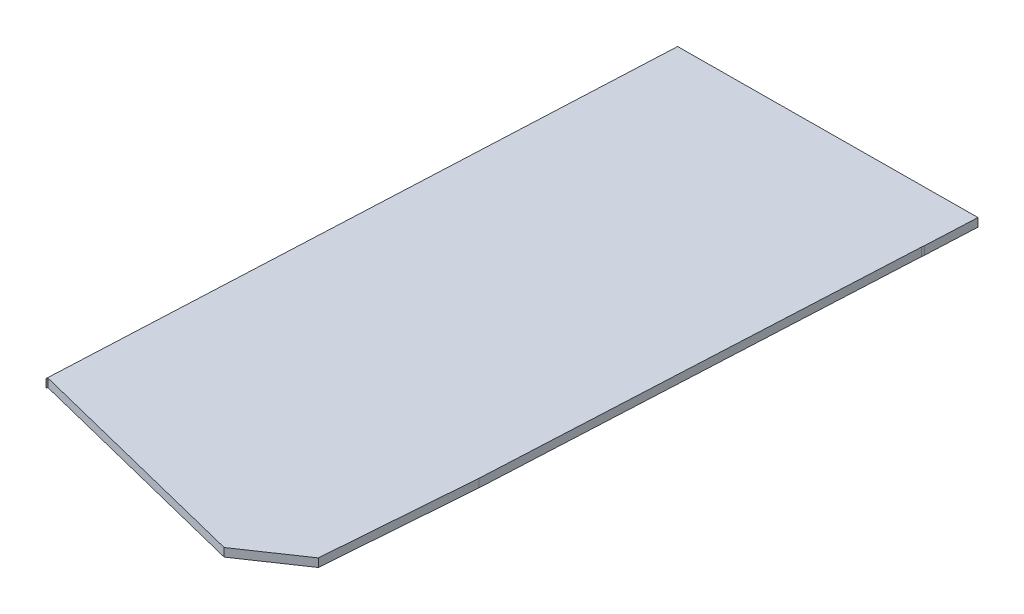
ISO-10303-21;
HEADER;
FILE_DESCRIPTION(('STEP AP214'),'2;1');
FILE_NAME('part.step','',(''),(''),'','','');
FILE_SCHEMA(('AUTOMOTIVE_DESIGN { 1 0 10303 214 1 1 1 1 }'));
ENDSEC;
DATA;
#1=APPLICATION_CONTEXT('core data for automotive mechanical design processes');
#2=APPLICATION_PROTOCOL_DEFINITION('international standard','automotive_design',2000,#1);
#3=PRODUCT_CONTEXT('',#1,'mechanical');
#4=PRODUCT('Part','Part','',(#3));
#5=PRODUCT_RELATED_PRODUCT_CATEGORY('part','',(#4));
#6=PRODUCT_DEFINITION_FORMATION('','',#4);
#7=PRODUCT_DEFINITION_CONTEXT('part definition',#1,'design');
#8=PRODUCT_DEFINITION('design','',#6,#7);
#9=PRODUCT_DEFINITION_SHAPE('','',#8);
#10=(LENGTH_UNIT() NAMED_UNIT(*) SI_UNIT(.MILLI.,.METRE.));
#11=(NAMED_UNIT(*) PLANE_ANGLE_UNIT() SI_UNIT($,.RADIAN.));
#12=(NAMED_UNIT(*) SI_UNIT($,.STERADIAN.) SOLID_ANGLE_UNIT());
#13=UNCERTAINTY_MEASURE_WITH_UNIT(LENGTH_MEASURE(1.E-05),#10,'distance_accuracy_value','');
#14=(GEOMETRIC_REPRESENTATION_CONTEXT(3) GLOBAL_UNCERTAINTY_ASSIGNED_CONTEXT((#13)) GLOBAL_UNIT_ASSIGNED_CONTEXT((#10,
#11,#12)) REPRESENTATION_CONTEXT('',''));
#15=CARTESIAN_POINT('',(0.,0.,0.));
#16=DIRECTION('',(0.,0.,1.));
#17=DIRECTION('',(1.,0.,0.));
#18=AXIS2_PLACEMENT_3D('',#15,#16,#17);
#19=CARTESIAN_POINT('',(78.5122731177693,2.,-145.5720124045));
#20=DIRECTION('',(0.00706068551905214,0.,0.999975073049324));
#21=DIRECTION('',(0.999975073049324,0.,-0.00706068551905214));
#22=AXIS2_PLACEMENT_3D('',#19,#20,#21);
#23=PLANE('',#22);
#24=DIRECTION('',(-0.999975073049324,0.,0.00706068551905214));
#25=VECTOR('',#24,1.);
#26=CARTESIAN_POINT('',(78.5122731177693,0.,-145.5720124045));
#27=LINE('',#26,#25);
#28=CARTESIAN_POINT('',(78.5122731177693,0.,-145.5720124045));
#29=VERTEX_POINT('',#28);
#30=CARTESIAN_POINT('',(6.79132851475084,0.,-145.06560074623));
#31=VERTEX_POINT('',#30);
#32=EDGE_CURVE('E146',#29,#31,#27,.T.);
#33=ORIENTED_EDGE('',*,*,#32,.T.);
#34=DIRECTION('',(0.,-1.,0.));
#35=VECTOR('',#34,1.);
#36=CARTESIAN_POINT('',(6.79132851475084,2.,-145.06560074623));
#37=LINE('',#36,#35);
#38=CARTESIAN_POINT('',(6.79132851475084,2.,-145.06560074623));
#39=VERTEX_POINT('',#38);
#40=EDGE_CURVE('E11',#39,#31,#37,.T.);
#41=ORIENTED_EDGE('',*,*,#40,.F.);
#42=DIRECTION('',(-0.999975073049324,0.,0.00706068551905214));
#43=VECTOR('',#42,1.);
#44=CARTESIAN_POINT('',(78.5122731177693,2.,-145.5720124045));
#45=LINE('',#44,#43);
#46=CARTESIAN_POINT('',(78.5122731177693,2.,-145.5720124045));
#47=VERTEX_POINT('',#46);
#48=EDGE_CURVE('E171',#47,#39,#45,.T.);
#49=ORIENTED_EDGE('',*,*,#48,.F.);
#50=DIRECTION('',(0.,-1.,0.));
#51=VECTOR('',#50,1.);
#52=CARTESIAN_POINT('',(78.5122731177693,2.,-145.5720124045));
#53=LINE('',#52,#51);
#54=EDGE_CURVE('E142',#47,#29,#53,.T.);
#55=ORIENTED_EDGE('',*,*,#54,.T.);
#56=EDGE_LOOP('',(#33,#41,#49,#55));
#57=FACE_BOUND('',#56,.T.);
#58=ADVANCED_FACE('F39',(#57),#23,.F.);
#59=CARTESIAN_POINT('',(6.79132851475084,2.,-145.06560074623));
#60=DIRECTION('',(0.99890594933335,0.,0.0467643495243868));
#61=DIRECTION('',(0.0467643495243868,0.,-0.99890594933335));
#62=AXIS2_PLACEMENT_3D('',#59,#60,#61);
#63=PLANE('',#62);
#64=DIRECTION('',(-0.0467643495243868,0.,0.99890594933335));
#65=VECTOR('',#64,1.);
#66=CARTESIAN_POINT('',(6.79132851475084,0.,-145.06560074623));
#67=LINE('',#66,#65);
#68=CARTESIAN_POINT('',(0.,0.,0.));
#69=VERTEX_POINT('',#68);
#70=EDGE_CURVE('E150',#31,#69,#67,.T.);
#71=ORIENTED_EDGE('',*,*,#70,.T.);
#72=DIRECTION('',(0.,-1.,0.));
#73=VECTOR('',#72,1.);
#74=CARTESIAN_POINT('',(0.,2.,0.));
#75=LINE('',#74,#73);
#76=CARTESIAN_POINT('',(0.,2.,0.));
#77=VERTEX_POINT('',#76);
#78=EDGE_CURVE('E48',#77,#69,#75,.T.);
#79=ORIENTED_EDGE('',*,*,#78,.F.);
#80=DIRECTION('',(-0.0467643495243868,0.,0.99890594933335));
#81=VECTOR('',#80,1.);
#82=CARTESIAN_POINT('',(6.79132851475084,2.,-145.06560074623));
#83=LINE('',#82,#81);
#84=EDGE_CURVE('E102',#39,#77,#83,.T.);
#85=ORIENTED_EDGE('',*,*,#84,.F.);
#86=ORIENTED_EDGE('',*,*,#40,.T.);
#87=EDGE_LOOP('',(#71,#79,#85,#86));
#88=FACE_BOUND('',#87,.T.);
#89=ADVANCED_FACE('F227',(#88),#63,.F.);
#90=CARTESIAN_POINT('',(0.,2.,0.));
#91=DIRECTION('',(-0.955824091980812,0.,-0.29393928827065));
#92=DIRECTION('',(-0.29393928827065,0.,0.955824091980812));
#93=AXIS2_PLACEMENT_3D('',#90,#91,#92);
#94=PLANE('',#93);
#95=DIRECTION('',(0.29393928827065,0.,-0.955824091980812));
#96=VECTOR('',#95,1.);
#97=CARTESIAN_POINT('',(0.,0.,0.));
#98=LINE('',#97,#96);
#99=CARTESIAN_POINT('',(0.10714054505967,0.,-0.348396823025898));
#100=VERTEX_POINT('',#99);
#101=EDGE_CURVE('E153',#69,#100,#98,.T.);
#102=ORIENTED_EDGE('',*,*,#101,.T.);
#103=DIRECTION('',(0.,-1.,0.));
#104=VECTOR('',#103,1.);
#105=CARTESIAN_POINT('',(0.10714054505967,2.,-0.348396823025898));
#106=LINE('',#105,#104);
#107=CARTESIAN_POINT('',(0.10714054505967,2.,-0.348396823025898));
#108=VERTEX_POINT('',#107);
#109=EDGE_CURVE('E186',#108,#100,#106,.T.);
#110=ORIENTED_EDGE('',*,*,#109,.F.);
#111=DIRECTION('',(0.29393928827065,0.,-0.955824091980812));
#112=VECTOR('',#111,1.);
#113=CARTESIAN_POINT('',(0.,2.,0.));
#114=LINE('',#113,#112);
#115=EDGE_CURVE('E196',#77,#108,#114,.T.);
#116=ORIENTED_EDGE('',*,*,#115,.F.);
#117=ORIENTED_EDGE('',*,*,#78,.T.);
#118=EDGE_LOOP('',(#102,#110,#116,#117));
#119=FACE_BOUND('',#118,.T.);
#120=ADVANCED_FACE('F194',(#119),#94,.F.);
#121=CARTESIAN_POINT('',(0.10714054505967,2.,-0.348396823025898));
#122=DIRECTION('',(0.242290699189532,0.,-0.970203698759311));
#123=DIRECTION('',(-0.970203698759311,0.,-0.242290699189532));
#124=AXIS2_PLACEMENT_3D('',#121,#122,#123);
#125=PLANE('',#124);
#126=DIRECTION('',(0.970203698759311,0.,0.242290699189532));
#127=VECTOR('',#126,1.);
#128=CARTESIAN_POINT('',(0.10714054505967,0.,-0.348396823025898));
#129=LINE('',#128,#127);
#130=CARTESIAN_POINT('',(56.6020075351961,0.,13.7601670189427));
#131=VERTEX_POINT('',#130);
#132=EDGE_CURVE('E156',#100,#131,#129,.T.);
#133=ORIENTED_EDGE('',*,*,#132,.T.);
#134=DIRECTION('',(0.,-1.,0.));
#135=VECTOR('',#134,1.);
#136=CARTESIAN_POINT('',(56.6020075351961,2.,13.7601670189427));
#137=LINE('',#136,#135);
#138=CARTESIAN_POINT('',(56.6020075351961,2.,13.7601670189427));
#139=VERTEX_POINT('',#138);
#140=EDGE_CURVE('E182',#139,#131,#137,.T.);
#141=ORIENTED_EDGE('',*,*,#140,.F.);
#142=DIRECTION('',(0.970203698759311,0.,0.242290699189532));
#143=VECTOR('',#142,1.);
#144=CARTESIAN_POINT('',(0.10714054505967,2.,-0.348396823025898));
#145=LINE('',#144,#143);
#146=EDGE_CURVE('E213',#108,#139,#145,.T.);
#147=ORIENTED_EDGE('',*,*,#146,.F.);
#148=ORIENTED_EDGE('',*,*,#109,.T.);
#149=EDGE_LOOP('',(#133,#141,#147,#148));
#150=FACE_BOUND('',#149,.T.);
#151=ADVANCED_FACE('F205',(#150),#125,.F.);
#152=CARTESIAN_POINT('',(56.6020075351961,2.,13.7601670189427));
#153=DIRECTION('',(-0.562251382768667,0.,-0.826966373303487));
#154=DIRECTION('',(-0.826966373303487,0.,0.562251382768667));
#155=AXIS2_PLACEMENT_3D('',#152,#153,#154);
#156=PLANE('',#155);
#157=DIRECTION('',(0.826966373303487,0.,-0.562251382768667));
#158=VECTOR('',#157,1.);
#159=CARTESIAN_POINT('',(56.6020075351961,0.,13.7601670189427));
#160=LINE('',#159,#158);
#161=CARTESIAN_POINT('',(70.0714926326931,0.,4.60231385135035));
#162=VERTEX_POINT('',#161);
#163=EDGE_CURVE('E159',#131,#162,#160,.T.);
#164=ORIENTED_EDGE('',*,*,#163,.T.);
#165=DIRECTION('',(0.,-1.,0.));
#166=VECTOR('',#165,1.);
#167=CARTESIAN_POINT('',(70.0714926326931,2.,4.60231385135035));
#168=LINE('',#167,#166);
#169=CARTESIAN_POINT('',(70.0714926326931,2.,4.60231385135035));
#170=VERTEX_POINT('',#169);
#171=EDGE_CURVE('E178',#170,#162,#168,.T.);
#172=ORIENTED_EDGE('',*,*,#171,.F.);
#173=DIRECTION('',(0.826966373303487,0.,-0.562251382768667));
#174=VECTOR('',#173,1.);
#175=CARTESIAN_POINT('',(56.6020075351961,2.,13.7601670189427));
#176=LINE('',#175,#174);
#177=EDGE_CURVE('E211',#139,#170,#176,.T.);
#178=ORIENTED_EDGE('',*,*,#177,.F.);
#179=ORIENTED_EDGE('',*,*,#140,.T.);
#180=EDGE_LOOP('',(#164,#172,#178,#179));
#181=FACE_BOUND('',#180,.T.);
#182=ADVANCED_FACE('F209',(#181),#156,.F.);
#183=CARTESIAN_POINT('',(70.0714926326931,2.,4.60231385135035));
#184=DIRECTION('',(-0.997091214581182,0.,-0.0762175163923815));
#185=DIRECTION('',(-0.0762175163923815,0.,0.997091214581182));
#186=AXIS2_PLACEMENT_3D('',#183,#184,#185);
#187=PLANE('',#186);
#188=DIRECTION('',(0.0762175163923815,0.,-0.997091214581182));
#189=VECTOR('',#188,1.);
#190=CARTESIAN_POINT('',(70.0714926326931,0.,4.60231385135035));
#191=LINE('',#190,#189);
#192=CARTESIAN_POINT('',(72.8173682621616,0.,-31.3197234449111));
#193=VERTEX_POINT('',#192);
#194=EDGE_CURVE('E162',#162,#193,#191,.T.);
#195=ORIENTED_EDGE('',*,*,#194,.T.);
#196=DIRECTION('',(0.,-1.,0.));
#197=VECTOR('',#196,1.);
#198=CARTESIAN_POINT('',(72.8173682621616,2.,-31.3197234449111));
#199=LINE('',#198,#197);
#200=CARTESIAN_POINT('',(72.8173682621616,2.,-31.3197234449111));
#201=VERTEX_POINT('',#200);
#202=EDGE_CURVE('E135',#201,#193,#199,.T.);
#203=ORIENTED_EDGE('',*,*,#202,.F.);
#204=DIRECTION('',(0.0762175163923815,0.,-0.997091214581182));
#205=VECTOR('',#204,1.);
#206=CARTESIAN_POINT('',(70.0714926326931,2.,4.60231385135035));
#207=LINE('',#206,#205);
#208=EDGE_CURVE('E124',#170,#201,#207,.T.);
#209=ORIENTED_EDGE('',*,*,#208,.F.);
#210=ORIENTED_EDGE('',*,*,#171,.T.);
#211=EDGE_LOOP('',(#195,#203,#209,#210));
#212=FACE_BOUND('',#211,.T.);
#213=ADVANCED_FACE('F239',(#212),#187,.F.);
#214=CARTESIAN_POINT('',(72.8173682621616,2.,-31.3197234449111));
#215=DIRECTION('',(-0.998760048239492,0.,-0.0497831903422078));
#216=DIRECTION('',(-0.0497831903422078,0.,0.998760048239492));
#217=AXIS2_PLACEMENT_3D('',#214,#215,#216);
#218=PLANE('',#217);
#219=DIRECTION('',(0.0497831903422078,0.,-0.998760048239492));
#220=VECTOR('',#219,1.);
#221=CARTESIAN_POINT('',(72.8173682621616,0.,-31.3197234449111));
#222=LINE('',#221,#220);
#223=CARTESIAN_POINT('',(77.8695071857924,0.,-132.676717249305));
#224=VERTEX_POINT('',#223);
#225=EDGE_CURVE('E133',#193,#224,#222,.T.);
#226=ORIENTED_EDGE('',*,*,#225,.T.);
#227=DIRECTION('',(0.,-1.,0.));
#228=VECTOR('',#227,1.);
#229=CARTESIAN_POINT('',(77.8695071857924,2.,-132.676717249305));
#230=LINE('',#229,#228);
#231=CARTESIAN_POINT('',(77.8695071857924,2.,-132.676717249305));
#232=VERTEX_POINT('',#231);
#233=EDGE_CURVE('E130',#232,#224,#230,.T.);
#234=ORIENTED_EDGE('',*,*,#233,.F.);
#235=DIRECTION('',(0.0497831903422078,0.,-0.998760048239492));
#236=VECTOR('',#235,1.);
#237=CARTESIAN_POINT('',(72.8173682621616,2.,-31.3197234449111));
#238=LINE('',#237,#236);
#239=EDGE_CURVE('E118',#201,#232,#238,.T.);
#240=ORIENTED_EDGE('',*,*,#239,.F.);
#241=ORIENTED_EDGE('',*,*,#202,.T.);
#242=EDGE_LOOP('',(#226,#234,#240,#241));
#243=FACE_BOUND('',#242,.T.);
#244=ADVANCED_FACE('F131',(#243),#218,.F.);
#245=CARTESIAN_POINT('',(77.8695071857924,2.,-132.676717249305));
#246=DIRECTION('',(-0.993286977625006,0.,-0.115676186315856));
#247=DIRECTION('',(-0.115676186315856,0.,0.993286977625006));
#248=AXIS2_PLACEMENT_3D('',#245,#246,#247);
#249=PLANE('',#248);
#250=DIRECTION('',(0.115676186315856,0.,-0.993286977625006));
#251=VECTOR('',#250,1.);
#252=CARTESIAN_POINT('',(77.8695071857924,0.,-132.676717249305));
#253=LINE('',#252,#251);
#254=CARTESIAN_POINT('',(77.9348333768656,0.,-133.237659453206));
#255=VERTEX_POINT('',#254);
#256=EDGE_CURVE('E88',#224,#255,#253,.T.);
#257=ORIENTED_EDGE('',*,*,#256,.T.);
#258=DIRECTION('',(0.,-1.,0.));
#259=VECTOR('',#258,1.);
#260=CARTESIAN_POINT('',(77.9348333768656,2.,-133.237659453206));
#261=LINE('',#260,#259);
#262=CARTESIAN_POINT('',(77.9348333768656,2.,-133.237659453206));
#263=VERTEX_POINT('',#262);
#264=EDGE_CURVE('E136',#263,#255,#261,.T.);
#265=ORIENTED_EDGE('',*,*,#264,.F.);
#266=DIRECTION('',(0.115676186315856,0.,-0.993286977625006));
#267=VECTOR('',#266,1.);
#268=CARTESIAN_POINT('',(77.8695071857924,2.,-132.676717249305));
#269=LINE('',#268,#267);
#270=EDGE_CURVE('E122',#232,#263,#269,.T.);
#271=ORIENTED_EDGE('',*,*,#270,.F.);
#272=ORIENTED_EDGE('',*,*,#233,.T.);
#273=EDGE_LOOP('',(#257,#265,#271,#272));
#274=FACE_BOUND('',#273,.T.);
#275=ADVANCED_FACE('F138',(#274),#249,.F.);
#276=CARTESIAN_POINT('',(77.9348333768656,2.,-133.237659453206));
#277=DIRECTION('',(-0.998905949333355,0.,-0.04676434952429));
#278=DIRECTION('',(-0.04676434952429,0.,0.998905949333355));
#279=AXIS2_PLACEMENT_3D('',#276,#277,#278);
#280=PLANE('',#279);
#281=DIRECTION('',(0.04676434952429,0.,-0.998905949333354));
#282=VECTOR('',#281,1.);
#283=CARTESIAN_POINT('',(77.9348333768656,0.,-133.237659453206));
#284=LINE('',#283,#282);
#285=EDGE_CURVE('E94',#255,#29,#284,.T.);
#286=ORIENTED_EDGE('',*,*,#285,.T.);
#287=ORIENTED_EDGE('',*,*,#54,.F.);
#288=DIRECTION('',(0.04676434952429,0.,-0.998905949333354));
#289=VECTOR('',#288,1.);
#290=CARTESIAN_POINT('',(77.9348333768656,2.,-133.237659453206));
#291=LINE('',#290,#289);
#292=EDGE_CURVE('E56',#263,#47,#291,.T.);
#293=ORIENTED_EDGE('',*,*,#292,.F.);
#294=ORIENTED_EDGE('',*,*,#264,.T.);
#295=EDGE_LOOP('',(#286,#287,#293,#294));
#296=FACE_BOUND('',#295,.T.);
#297=ADVANCED_FACE('F247',(#296),#280,.F.);
#298=CARTESIAN_POINT('',(0.,2.,0.));
#299=DIRECTION('',(0.,1.,0.));
#300=DIRECTION('',(0.,0.,1.));
#301=AXIS2_PLACEMENT_3D('',#298,#299,#300);
#302=PLANE('',#301);
#303=ORIENTED_EDGE('',*,*,#48,.T.);
#304=ORIENTED_EDGE('',*,*,#84,.T.);
#305=ORIENTED_EDGE('',*,*,#115,.T.);
#306=ORIENTED_EDGE('',*,*,#146,.T.);
#307=ORIENTED_EDGE('',*,*,#177,.T.);
#308=ORIENTED_EDGE('',*,*,#208,.T.);
#309=ORIENTED_EDGE('',*,*,#239,.T.);
#310=ORIENTED_EDGE('',*,*,#270,.T.);
#311=ORIENTED_EDGE('',*,*,#292,.T.);
#312=EDGE_LOOP('',(#303,#304,#305,#306,#307,#308,#309,#310,#311));
#313=FACE_BOUND('',#312,.T.);
#314=ADVANCED_FACE('F120',(#313),#302,.T.);
#315=CARTESIAN_POINT('',(0.,0.,0.));
#316=DIRECTION('',(0.,1.,0.));
#317=DIRECTION('',(0.,0.,1.));
#318=AXIS2_PLACEMENT_3D('',#315,#316,#317);
#319=PLANE('',#318);
#320=ORIENTED_EDGE('',*,*,#32,.F.);
#321=ORIENTED_EDGE('',*,*,#285,.F.);
#322=ORIENTED_EDGE('',*,*,#256,.F.);
#323=ORIENTED_EDGE('',*,*,#225,.F.);
#324=ORIENTED_EDGE('',*,*,#194,.F.);
#325=ORIENTED_EDGE('',*,*,#163,.F.);
#326=ORIENTED_EDGE('',*,*,#132,.F.);
#327=ORIENTED_EDGE('',*,*,#101,.F.);
#328=ORIENTED_EDGE('',*,*,#70,.F.);
#329=EDGE_LOOP('',(#320,#321,#322,#323,#324,#325,#326,#327,#328));
#330=FACE_BOUND('',#329,.T.);
#331=ADVANCED_FACE('F200',(#330),#319,.F.);
#332=CLOSED_SHELL('',(#58,#89,#120,#151,#182,#213,#244,#275,#297,#314,#331));
#333=MANIFOLD_SOLID_BREP('B2',#332);
#334=ADVANCED_BREP_SHAPE_REPRESENTATION('',(#18,#333),#14);
#335=SHAPE_DEFINITION_REPRESENTATION(#9,#334);
ENDSEC;
END-ISO-10303-21;
